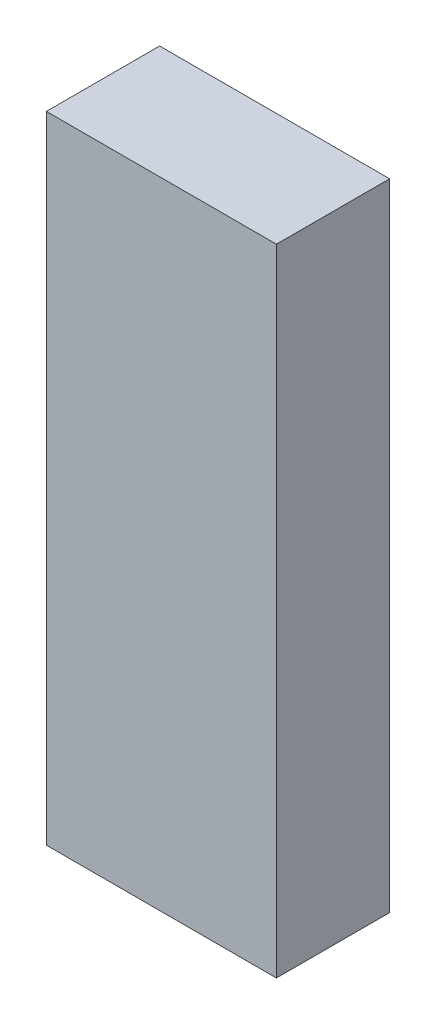
ISO-10303-21;
HEADER;
FILE_DESCRIPTION(('STEP AP214'),'2;1');
FILE_NAME('part.step','',(''),(''),'','','');
FILE_SCHEMA(('AUTOMOTIVE_DESIGN { 1 0 10303 214 1 1 1 1 }'));
ENDSEC;
DATA;
#1=APPLICATION_CONTEXT('core data for automotive mechanical design processes');
#2=APPLICATION_PROTOCOL_DEFINITION('international standard','automotive_design',2000,#1);
#3=PRODUCT_CONTEXT('',#1,'mechanical');
#4=PRODUCT('Part','Part','',(#3));
#5=PRODUCT_RELATED_PRODUCT_CATEGORY('part','',(#4));
#6=PRODUCT_DEFINITION_FORMATION('','',#4);
#7=PRODUCT_DEFINITION_CONTEXT('part definition',#1,'design');
#8=PRODUCT_DEFINITION('design','',#6,#7);
#9=PRODUCT_DEFINITION_SHAPE('','',#8);
#10=(LENGTH_UNIT() NAMED_UNIT(*) SI_UNIT(.MILLI.,.METRE.));
#11=(NAMED_UNIT(*) PLANE_ANGLE_UNIT() SI_UNIT($,.RADIAN.));
#12=(NAMED_UNIT(*) SI_UNIT($,.STERADIAN.) SOLID_ANGLE_UNIT());
#13=UNCERTAINTY_MEASURE_WITH_UNIT(LENGTH_MEASURE(1.E-05),#10,'distance_accuracy_value','');
#14=(GEOMETRIC_REPRESENTATION_CONTEXT(3) GLOBAL_UNCERTAINTY_ASSIGNED_CONTEXT((#13)) GLOBAL_UNIT_ASSIGNED_CONTEXT((#10,
#11,#12)) REPRESENTATION_CONTEXT('',''));
#15=CARTESIAN_POINT('',(0.,0.,0.));
#16=DIRECTION('',(0.,0.,1.));
#17=DIRECTION('',(1.,0.,0.));
#18=AXIS2_PLACEMENT_3D('',#15,#16,#17);
#19=CARTESIAN_POINT('',(-0.32500316,0.45719492,0.31999936));
#20=DIRECTION('',(0.,0.,-1.));
#21=DIRECTION('',(-1.,0.,0.));
#22=AXIS2_PLACEMENT_3D('',#19,#20,#21);
#23=PLANE('',#22);
#24=DIRECTION('',(1.,0.,0.));
#25=VECTOR('',#24,1.);
#26=CARTESIAN_POINT('',(-0.32500316,-1.3386308,0.31999936));
#27=LINE('',#26,#25);
#28=CARTESIAN_POINT('',(-0.32500316,-1.3386308,0.31999936));
#29=VERTEX_POINT('',#28);
#30=CARTESIAN_POINT('',(0.32499808,-1.3386308,0.31999936));
#31=VERTEX_POINT('',#30);
#32=EDGE_CURVE('E54',#29,#31,#27,.T.);
#33=ORIENTED_EDGE('',*,*,#32,.T.);
#34=DIRECTION('',(0.,1.,0.));
#35=VECTOR('',#34,1.);
#36=CARTESIAN_POINT('',(0.32499808,-1.3386308,0.31999936));
#37=LINE('',#36,#35);
#38=CARTESIAN_POINT('',(0.32499808,0.45719492,0.31999936));
#39=VERTEX_POINT('',#38);
#40=EDGE_CURVE('E56',#31,#39,#37,.T.);
#41=ORIENTED_EDGE('',*,*,#40,.T.);
#42=DIRECTION('',(1.,0.,0.));
#43=VECTOR('',#42,1.);
#44=CARTESIAN_POINT('',(0.32499808,0.45719492,0.31999936));
#45=LINE('',#44,#43);
#46=CARTESIAN_POINT('',(-0.32500316,0.45719492,0.31999936));
#47=VERTEX_POINT('',#46);
#48=EDGE_CURVE('E19',#39,#47,#45,.F.);
#49=ORIENTED_EDGE('',*,*,#48,.T.);
#50=DIRECTION('',(0.,1.,0.));
#51=VECTOR('',#50,1.);
#52=CARTESIAN_POINT('',(-0.32500316,0.45719492,0.31999936));
#53=LINE('',#52,#51);
#54=EDGE_CURVE('E79',#47,#29,#53,.F.);
#55=ORIENTED_EDGE('',*,*,#54,.T.);
#56=EDGE_LOOP('',(#33,#41,#49,#55));
#57=FACE_BOUND('',#56,.T.);
#58=ADVANCED_FACE('F16',(#57),#23,.F.);
#59=CARTESIAN_POINT('',(0.32499808,0.45719492,0.));
#60=DIRECTION('',(0.,-1.,0.));
#61=DIRECTION('',(0.,0.,-1.));
#62=AXIS2_PLACEMENT_3D('',#59,#60,#61);
#63=PLANE('',#62);
#64=DIRECTION('',(0.,0.,-1.));
#65=VECTOR('',#64,1.);
#66=CARTESIAN_POINT('',(-0.32500316,0.45719492,0.));
#67=LINE('',#66,#65);
#68=CARTESIAN_POINT('',(-0.32500316,0.45719492,0.));
#69=VERTEX_POINT('',#68);
#70=EDGE_CURVE('E67',#69,#47,#67,.F.);
#71=ORIENTED_EDGE('',*,*,#70,.T.);
#72=ORIENTED_EDGE('',*,*,#48,.F.);
#73=DIRECTION('',(0.,0.,1.));
#74=VECTOR('',#73,1.);
#75=CARTESIAN_POINT('',(0.32499808,0.45719492,0.));
#76=LINE('',#75,#74);
#77=CARTESIAN_POINT('',(0.32499808,0.45719492,0.));
#78=VERTEX_POINT('',#77);
#79=EDGE_CURVE('E62',#39,#78,#76,.F.);
#80=ORIENTED_EDGE('',*,*,#79,.T.);
#81=DIRECTION('',(-1.,0.,0.));
#82=VECTOR('',#81,1.);
#83=CARTESIAN_POINT('',(-0.32500316,0.45719492,0.));
#84=LINE('',#83,#82);
#85=EDGE_CURVE('E82',#69,#78,#84,.F.);
#86=ORIENTED_EDGE('',*,*,#85,.F.);
#87=EDGE_LOOP('',(#71,#72,#80,#86));
#88=FACE_BOUND('',#87,.T.);
#89=ADVANCED_FACE('F64',(#88),#63,.F.);
#90=CARTESIAN_POINT('',(0.32499808,-1.3386308,0.));
#91=DIRECTION('',(-1.,0.,0.));
#92=DIRECTION('',(0.,0.,1.));
#93=AXIS2_PLACEMENT_3D('',#90,#91,#92);
#94=PLANE('',#93);
#95=ORIENTED_EDGE('',*,*,#79,.F.);
#96=ORIENTED_EDGE('',*,*,#40,.F.);
#97=DIRECTION('',(0.,0.,1.));
#98=VECTOR('',#97,1.);
#99=CARTESIAN_POINT('',(0.32499808,-1.3386308,0.));
#100=LINE('',#99,#98);
#101=CARTESIAN_POINT('',(0.32499808,-1.3386308,0.));
#102=VERTEX_POINT('',#101);
#103=EDGE_CURVE('E74',#31,#102,#100,.F.);
#104=ORIENTED_EDGE('',*,*,#103,.T.);
#105=DIRECTION('',(0.,1.,0.));
#106=VECTOR('',#105,1.);
#107=CARTESIAN_POINT('',(0.32499808,0.45719492,0.));
#108=LINE('',#107,#106);
#109=EDGE_CURVE('E71',#78,#102,#108,.F.);
#110=ORIENTED_EDGE('',*,*,#109,.F.);
#111=EDGE_LOOP('',(#95,#96,#104,#110));
#112=FACE_BOUND('',#111,.T.);
#113=ADVANCED_FACE('F69',(#112),#94,.F.);
#114=CARTESIAN_POINT('',(-0.32500316,-1.3386308,0.));
#115=DIRECTION('',(0.,1.,0.));
#116=DIRECTION('',(0.,0.,1.));
#117=AXIS2_PLACEMENT_3D('',#114,#115,#116);
#118=PLANE('',#117);
#119=ORIENTED_EDGE('',*,*,#103,.F.);
#120=ORIENTED_EDGE('',*,*,#32,.F.);
#121=DIRECTION('',(0.,0.,-1.));
#122=VECTOR('',#121,1.);
#123=CARTESIAN_POINT('',(-0.32500316,-1.3386308,0.));
#124=LINE('',#123,#122);
#125=CARTESIAN_POINT('',(-0.32500316,-1.3386308,0.));
#126=VERTEX_POINT('',#125);
#127=EDGE_CURVE('E34',#29,#126,#124,.T.);
#128=ORIENTED_EDGE('',*,*,#127,.T.);
#129=DIRECTION('',(-1.,0.,0.));
#130=VECTOR('',#129,1.);
#131=CARTESIAN_POINT('',(-0.32500316,-1.3386308,0.));
#132=LINE('',#131,#130);
#133=EDGE_CURVE('E25',#102,#126,#132,.T.);
#134=ORIENTED_EDGE('',*,*,#133,.F.);
#135=EDGE_LOOP('',(#119,#120,#128,#134));
#136=FACE_BOUND('',#135,.T.);
#137=ADVANCED_FACE('F88',(#136),#118,.F.);
#138=CARTESIAN_POINT('',(-0.32500316,0.45719492,0.));
#139=DIRECTION('',(1.,0.,0.));
#140=DIRECTION('',(0.,0.,-1.));
#141=AXIS2_PLACEMENT_3D('',#138,#139,#140);
#142=PLANE('',#141);
#143=ORIENTED_EDGE('',*,*,#127,.F.);
#144=ORIENTED_EDGE('',*,*,#54,.F.);
#145=ORIENTED_EDGE('',*,*,#70,.F.);
#146=DIRECTION('',(0.,1.,0.));
#147=VECTOR('',#146,1.);
#148=CARTESIAN_POINT('',(-0.32500316,0.45719492,0.));
#149=LINE('',#148,#147);
#150=EDGE_CURVE('E11',#126,#69,#149,.T.);
#151=ORIENTED_EDGE('',*,*,#150,.F.);
#152=EDGE_LOOP('',(#143,#144,#145,#151));
#153=FACE_BOUND('',#152,.T.);
#154=ADVANCED_FACE('F90',(#153),#142,.F.);
#155=CARTESIAN_POINT('',(-0.32500316,0.45719492,0.));
#156=DIRECTION('',(0.,0.,-1.));
#157=DIRECTION('',(-1.,0.,0.));
#158=AXIS2_PLACEMENT_3D('',#155,#156,#157);
#159=PLANE('',#158);
#160=ORIENTED_EDGE('',*,*,#133,.T.);
#161=ORIENTED_EDGE('',*,*,#150,.T.);
#162=ORIENTED_EDGE('',*,*,#85,.T.);
#163=ORIENTED_EDGE('',*,*,#109,.T.);
#164=EDGE_LOOP('',(#160,#161,#162,#163));
#165=FACE_BOUND('',#164,.T.);
#166=ADVANCED_FACE('F87',(#165),#159,.T.);
#167=CLOSED_SHELL('',(#58,#89,#113,#137,#154,#166));
#168=MANIFOLD_SOLID_BREP('B1',#167);
#169=ADVANCED_BREP_SHAPE_REPRESENTATION('',(#18,#168),#14);
#170=SHAPE_DEFINITION_REPRESENTATION(#9,#169);
ENDSEC;
END-ISO-10303-21;
